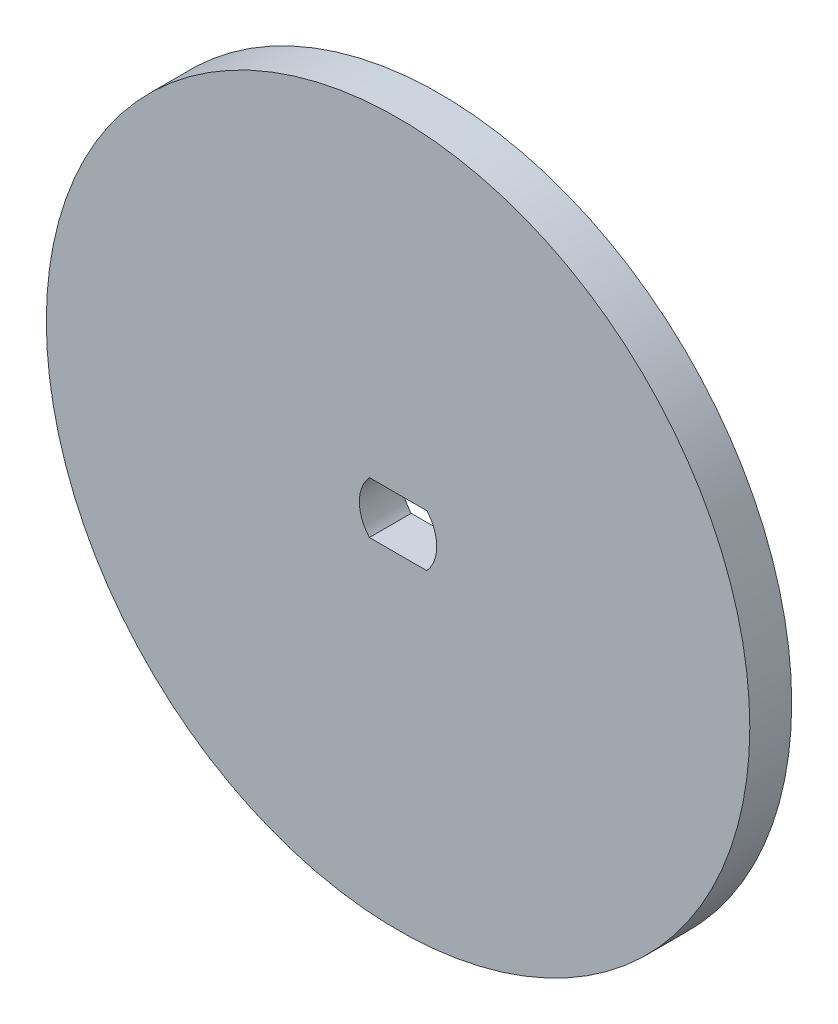
ISO-10303-21;
HEADER;
FILE_DESCRIPTION(('STEP AP214'),'2;1');
FILE_NAME('part.step','',(''),(''),'','','');
FILE_SCHEMA(('AUTOMOTIVE_DESIGN { 1 0 10303 214 1 1 1 1 }'));
ENDSEC;
DATA;
#1=APPLICATION_CONTEXT('core data for automotive mechanical design processes');
#2=APPLICATION_PROTOCOL_DEFINITION('international standard','automotive_design',2000,#1);
#3=PRODUCT_CONTEXT('',#1,'mechanical');
#4=PRODUCT('Part','Part','',(#3));
#5=PRODUCT_RELATED_PRODUCT_CATEGORY('part','',(#4));
#6=PRODUCT_DEFINITION_FORMATION('','',#4);
#7=PRODUCT_DEFINITION_CONTEXT('part definition',#1,'design');
#8=PRODUCT_DEFINITION('design','',#6,#7);
#9=PRODUCT_DEFINITION_SHAPE('','',#8);
#10=(LENGTH_UNIT() NAMED_UNIT(*) SI_UNIT(.MILLI.,.METRE.));
#11=(NAMED_UNIT(*) PLANE_ANGLE_UNIT() SI_UNIT($,.RADIAN.));
#12=(NAMED_UNIT(*) SI_UNIT($,.STERADIAN.) SOLID_ANGLE_UNIT());
#13=UNCERTAINTY_MEASURE_WITH_UNIT(LENGTH_MEASURE(1.E-05),#10,'distance_accuracy_value','');
#14=(GEOMETRIC_REPRESENTATION_CONTEXT(3) GLOBAL_UNCERTAINTY_ASSIGNED_CONTEXT((#13)) GLOBAL_UNIT_ASSIGNED_CONTEXT((#10,
#11,#12)) REPRESENTATION_CONTEXT('',''));
#15=CARTESIAN_POINT('',(0.,0.,0.));
#16=DIRECTION('',(0.,0.,1.));
#17=DIRECTION('',(1.,0.,0.));
#18=AXIS2_PLACEMENT_3D('',#15,#16,#17);
#19=CARTESIAN_POINT('',(0.,0.,3.175));
#20=DIRECTION('',(0.,0.,-1.));
#21=DIRECTION('',(-1.,0.,0.));
#22=AXIS2_PLACEMENT_3D('',#19,#20,#21);
#23=CYLINDRICAL_SURFACE('',#22,2.9337);
#24=CARTESIAN_POINT('',(0.,0.,0.));
#25=DIRECTION('',(0.,0.,1.));
#26=DIRECTION('',(1.,0.,0.));
#27=AXIS2_PLACEMENT_3D('',#24,#25,#26);
#28=CIRCLE('',#27,2.9337);
#29=CARTESIAN_POINT('',(-2.17522491710627,1.9685,0.));
#30=VERTEX_POINT('',#29);
#31=CARTESIAN_POINT('',(-2.17522491710627,-1.9685,0.));
#32=VERTEX_POINT('',#31);
#33=EDGE_CURVE('E102',#30,#32,#28,.T.);
#34=ORIENTED_EDGE('',*,*,#33,.F.);
#35=DIRECTION('',(0.,0.,-1.));
#36=VECTOR('',#35,1.);
#37=CARTESIAN_POINT('',(-2.17522491710627,1.9685,3.175));
#38=LINE('',#37,#36);
#39=CARTESIAN_POINT('',(-2.17522491710627,1.9685,3.175));
#40=VERTEX_POINT('',#39);
#41=EDGE_CURVE('E11',#40,#30,#38,.T.);
#42=ORIENTED_EDGE('',*,*,#41,.F.);
#43=CARTESIAN_POINT('',(0.,0.,3.175));
#44=DIRECTION('',(0.,0.,1.));
#45=DIRECTION('',(1.,0.,0.));
#46=AXIS2_PLACEMENT_3D('',#43,#44,#45);
#47=CIRCLE('',#46,2.9337);
#48=CARTESIAN_POINT('',(-2.17522491710627,-1.9685,3.175));
#49=VERTEX_POINT('',#48);
#50=EDGE_CURVE('E84',#40,#49,#47,.T.);
#51=ORIENTED_EDGE('',*,*,#50,.T.);
#52=DIRECTION('',(0.,0.,-1.));
#53=VECTOR('',#52,1.);
#54=CARTESIAN_POINT('',(-2.17522491710627,-1.9685,3.175));
#55=LINE('',#54,#53);
#56=EDGE_CURVE('E51',#49,#32,#55,.T.);
#57=ORIENTED_EDGE('',*,*,#56,.T.);
#58=EDGE_LOOP('',(#34,#42,#51,#57));
#59=FACE_BOUND('',#58,.T.);
#60=ADVANCED_FACE('F35',(#59),#23,.F.);
#61=CARTESIAN_POINT('',(0.,1.9685,3.175));
#62=DIRECTION('',(0.,1.,0.));
#63=DIRECTION('',(0.,0.,1.));
#64=AXIS2_PLACEMENT_3D('',#61,#62,#63);
#65=PLANE('',#64);
#66=DIRECTION('',(1.,0.,0.));
#67=VECTOR('',#66,1.);
#68=CARTESIAN_POINT('',(0.,1.9685,0.));
#69=LINE('',#68,#67);
#70=CARTESIAN_POINT('',(2.17522491710627,1.9685,0.));
#71=VERTEX_POINT('',#70);
#72=EDGE_CURVE('E90',#30,#71,#69,.T.);
#73=ORIENTED_EDGE('',*,*,#72,.T.);
#74=DIRECTION('',(0.,0.,-1.));
#75=VECTOR('',#74,1.);
#76=CARTESIAN_POINT('',(2.17522491710627,1.9685,3.175));
#77=LINE('',#76,#75);
#78=CARTESIAN_POINT('',(2.17522491710627,1.9685,3.175));
#79=VERTEX_POINT('',#78);
#80=EDGE_CURVE('E43',#79,#71,#77,.T.);
#81=ORIENTED_EDGE('',*,*,#80,.F.);
#82=DIRECTION('',(1.,0.,0.));
#83=VECTOR('',#82,1.);
#84=CARTESIAN_POINT('',(0.,1.9685,3.175));
#85=LINE('',#84,#83);
#86=EDGE_CURVE('E77',#40,#79,#85,.T.);
#87=ORIENTED_EDGE('',*,*,#86,.F.);
#88=ORIENTED_EDGE('',*,*,#41,.T.);
#89=EDGE_LOOP('',(#73,#81,#87,#88));
#90=FACE_BOUND('',#89,.T.);
#91=ADVANCED_FACE('F88',(#90),#65,.F.);
#92=CARTESIAN_POINT('',(0.,0.,3.175));
#93=DIRECTION('',(0.,0.,-1.));
#94=DIRECTION('',(-1.,0.,0.));
#95=AXIS2_PLACEMENT_3D('',#92,#93,#94);
#96=CYLINDRICAL_SURFACE('',#95,2.9337);
#97=CARTESIAN_POINT('',(0.,0.,0.));
#98=DIRECTION('',(0.,0.,1.));
#99=DIRECTION('',(1.,0.,0.));
#100=AXIS2_PLACEMENT_3D('',#97,#98,#99);
#101=CIRCLE('',#100,2.9337);
#102=CARTESIAN_POINT('',(2.17522491710627,-1.9685,0.));
#103=VERTEX_POINT('',#102);
#104=EDGE_CURVE('E105',#103,#71,#101,.T.);
#105=ORIENTED_EDGE('',*,*,#104,.F.);
#106=DIRECTION('',(0.,0.,-1.));
#107=VECTOR('',#106,1.);
#108=CARTESIAN_POINT('',(2.17522491710627,-1.9685,3.175));
#109=LINE('',#108,#107);
#110=CARTESIAN_POINT('',(2.17522491710627,-1.9685,3.175));
#111=VERTEX_POINT('',#110);
#112=EDGE_CURVE('E64',#111,#103,#109,.T.);
#113=ORIENTED_EDGE('',*,*,#112,.F.);
#114=CARTESIAN_POINT('',(0.,0.,3.175));
#115=DIRECTION('',(0.,0.,1.));
#116=DIRECTION('',(1.,0.,0.));
#117=AXIS2_PLACEMENT_3D('',#114,#115,#116);
#118=CIRCLE('',#117,2.9337);
#119=EDGE_CURVE('E83',#111,#79,#118,.T.);
#120=ORIENTED_EDGE('',*,*,#119,.T.);
#121=ORIENTED_EDGE('',*,*,#80,.T.);
#122=EDGE_LOOP('',(#105,#113,#120,#121));
#123=FACE_BOUND('',#122,.T.);
#124=ADVANCED_FACE('F93',(#123),#96,.F.);
#125=CARTESIAN_POINT('',(0.,-1.9685,3.175));
#126=DIRECTION('',(0.,1.,0.));
#127=DIRECTION('',(0.,0.,1.));
#128=AXIS2_PLACEMENT_3D('',#125,#126,#127);
#129=PLANE('',#128);
#130=DIRECTION('',(1.,0.,0.));
#131=VECTOR('',#130,1.);
#132=CARTESIAN_POINT('',(0.,-1.9685,0.));
#133=LINE('',#132,#131);
#134=EDGE_CURVE('E107',#32,#103,#133,.T.);
#135=ORIENTED_EDGE('',*,*,#134,.F.);
#136=ORIENTED_EDGE('',*,*,#56,.F.);
#137=DIRECTION('',(1.,0.,0.));
#138=VECTOR('',#137,1.);
#139=CARTESIAN_POINT('',(0.,-1.9685,3.175));
#140=LINE('',#139,#138);
#141=EDGE_CURVE('E94',#49,#111,#140,.T.);
#142=ORIENTED_EDGE('',*,*,#141,.T.);
#143=ORIENTED_EDGE('',*,*,#112,.T.);
#144=EDGE_LOOP('',(#135,#136,#142,#143));
#145=FACE_BOUND('',#144,.T.);
#146=ADVANCED_FACE('F116',(#145),#129,.T.);
#147=CARTESIAN_POINT('',(0.,0.,3.175));
#148=DIRECTION('',(0.,0.,-1.));
#149=DIRECTION('',(-1.,0.,0.));
#150=AXIS2_PLACEMENT_3D('',#147,#148,#149);
#151=CYLINDRICAL_SURFACE('',#150,26.67);
#152=CARTESIAN_POINT('',(0.,0.,3.175));
#153=DIRECTION('',(0.,0.,1.));
#154=DIRECTION('',(1.,0.,0.));
#155=AXIS2_PLACEMENT_3D('',#152,#153,#154);
#156=CIRCLE('',#155,26.67);
#157=CARTESIAN_POINT('',(26.67,0.,3.175));
#158=VERTEX_POINT('',#157);
#159=EDGE_CURVE('E96',#158,#158,#156,.T.);
#160=ORIENTED_EDGE('',*,*,#159,.F.);
#161=EDGE_LOOP('',(#160));
#162=FACE_BOUND('',#161,.T.);
#163=CARTESIAN_POINT('',(0.,0.,0.));
#164=DIRECTION('',(0.,0.,1.));
#165=DIRECTION('',(1.,0.,0.));
#166=AXIS2_PLACEMENT_3D('',#163,#164,#165);
#167=CIRCLE('',#166,26.67);
#168=CARTESIAN_POINT('',(26.67,0.,0.));
#169=VERTEX_POINT('',#168);
#170=EDGE_CURVE('E110',#169,#169,#167,.T.);
#171=ORIENTED_EDGE('',*,*,#170,.T.);
#172=EDGE_LOOP('',(#171));
#173=FACE_BOUND('',#172,.T.);
#174=ADVANCED_FACE('F118',(#162,#173),#151,.T.);
#175=CARTESIAN_POINT('',(0.,0.,3.175));
#176=DIRECTION('',(0.,0.,1.));
#177=DIRECTION('',(1.,0.,0.));
#178=AXIS2_PLACEMENT_3D('',#175,#176,#177);
#179=PLANE('',#178);
#180=ORIENTED_EDGE('',*,*,#50,.F.);
#181=ORIENTED_EDGE('',*,*,#86,.T.);
#182=ORIENTED_EDGE('',*,*,#119,.F.);
#183=ORIENTED_EDGE('',*,*,#141,.F.);
#184=EDGE_LOOP('',(#180,#181,#182,#183));
#185=FACE_BOUND('',#184,.T.);
#186=ORIENTED_EDGE('',*,*,#159,.T.);
#187=EDGE_LOOP('',(#186));
#188=FACE_BOUND('',#187,.T.);
#189=ADVANCED_FACE('F79',(#185,#188),#179,.T.);
#190=CARTESIAN_POINT('',(0.,0.,0.));
#191=DIRECTION('',(0.,0.,1.));
#192=DIRECTION('',(1.,0.,0.));
#193=AXIS2_PLACEMENT_3D('',#190,#191,#192);
#194=PLANE('',#193);
#195=ORIENTED_EDGE('',*,*,#33,.T.);
#196=ORIENTED_EDGE('',*,*,#134,.T.);
#197=ORIENTED_EDGE('',*,*,#104,.T.);
#198=ORIENTED_EDGE('',*,*,#72,.F.);
#199=EDGE_LOOP('',(#195,#196,#197,#198));
#200=FACE_BOUND('',#199,.T.);
#201=ORIENTED_EDGE('',*,*,#170,.F.);
#202=EDGE_LOOP('',(#201));
#203=FACE_BOUND('',#202,.T.);
#204=ADVANCED_FACE('F156',(#200,#203),#194,.F.);
#205=CLOSED_SHELL('',(#60,#91,#124,#146,#174,#189,#204));
#206=MANIFOLD_SOLID_BREP('B2',#205);
#207=ADVANCED_BREP_SHAPE_REPRESENTATION('',(#18,#206),#14);
#208=SHAPE_DEFINITION_REPRESENTATION(#9,#207);
ENDSEC;
END-ISO-10303-21;
